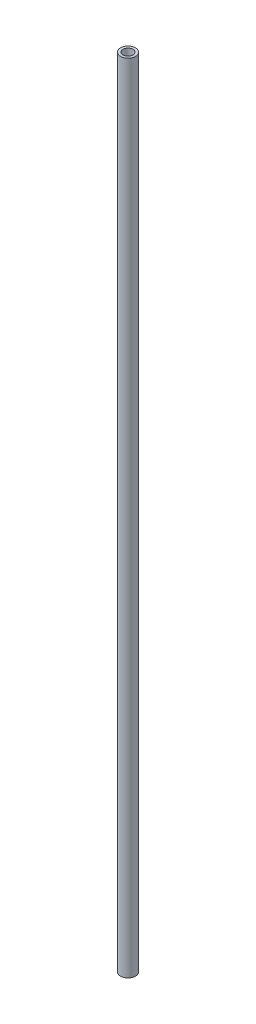
ISO-10303-21;
HEADER;
FILE_DESCRIPTION(('STEP AP214'),'2;1');
FILE_NAME('part.step','',(''),(''),'','','');
FILE_SCHEMA(('AUTOMOTIVE_DESIGN { 1 0 10303 214 1 1 1 1 }'));
ENDSEC;
DATA;
#1=APPLICATION_CONTEXT('core data for automotive mechanical design processes');
#2=APPLICATION_PROTOCOL_DEFINITION('international standard','automotive_design',2000,#1);
#3=PRODUCT_CONTEXT('',#1,'mechanical');
#4=PRODUCT('Part','Part','',(#3));
#5=PRODUCT_RELATED_PRODUCT_CATEGORY('part','',(#4));
#6=PRODUCT_DEFINITION_FORMATION('','',#4);
#7=PRODUCT_DEFINITION_CONTEXT('part definition',#1,'design');
#8=PRODUCT_DEFINITION('design','',#6,#7);
#9=PRODUCT_DEFINITION_SHAPE('','',#8);
#10=(LENGTH_UNIT() NAMED_UNIT(*) SI_UNIT(.MILLI.,.METRE.));
#11=(NAMED_UNIT(*) PLANE_ANGLE_UNIT() SI_UNIT($,.RADIAN.));
#12=(NAMED_UNIT(*) SI_UNIT($,.STERADIAN.) SOLID_ANGLE_UNIT());
#13=UNCERTAINTY_MEASURE_WITH_UNIT(LENGTH_MEASURE(1.E-05),#10,'distance_accuracy_value','');
#14=(GEOMETRIC_REPRESENTATION_CONTEXT(3) GLOBAL_UNCERTAINTY_ASSIGNED_CONTEXT((#13)) GLOBAL_UNIT_ASSIGNED_CONTEXT((#10,
#11,#12)) REPRESENTATION_CONTEXT('',''));
#15=CARTESIAN_POINT('',(0.,0.,0.));
#16=DIRECTION('',(0.,0.,1.));
#17=DIRECTION('',(1.,0.,0.));
#18=AXIS2_PLACEMENT_3D('',#15,#16,#17);
#19=CARTESIAN_POINT('',(0.,1016.,0.));
#20=DIRECTION('',(0.,1.,0.));
#21=DIRECTION('',(0.,0.,1.));
#22=AXIS2_PLACEMENT_3D('',#19,#20,#21);
#23=PLANE('',#22);
#24=CARTESIAN_POINT('',(0.,1016.,0.));
#25=DIRECTION('',(0.,1.,0.));
#26=DIRECTION('',(0.,0.,1.));
#27=AXIS2_PLACEMENT_3D('',#24,#25,#26);
#28=CIRCLE('',#27,9.525);
#29=CARTESIAN_POINT('',(0.,1016.,9.525));
#30=VERTEX_POINT('',#29);
#31=EDGE_CURVE('E10',#30,#30,#28,.T.);
#32=ORIENTED_EDGE('',*,*,#31,.T.);
#33=EDGE_LOOP('',(#32));
#34=FACE_BOUND('',#33,.T.);
#35=CARTESIAN_POINT('',(0.,1016.,0.));
#36=DIRECTION('',(0.,1.,0.));
#37=DIRECTION('',(0.,0.,1.));
#38=AXIS2_PLACEMENT_3D('',#35,#36,#37);
#39=CIRCLE('',#38,6.35);
#40=CARTESIAN_POINT('',(0.,1016.,6.35));
#41=VERTEX_POINT('',#40);
#42=EDGE_CURVE('E50',#41,#41,#39,.T.);
#43=ORIENTED_EDGE('',*,*,#42,.F.);
#44=EDGE_LOOP('',(#43));
#45=FACE_BOUND('',#44,.T.);
#46=ADVANCED_FACE('F37',(#34,#45),#23,.T.);
#47=CARTESIAN_POINT('',(0.,0.,0.));
#48=DIRECTION('',(0.,1.,0.));
#49=DIRECTION('',(0.,0.,1.));
#50=AXIS2_PLACEMENT_3D('',#47,#48,#49);
#51=PLANE('',#50);
#52=CARTESIAN_POINT('',(0.,0.,0.));
#53=DIRECTION('',(0.,1.,0.));
#54=DIRECTION('',(0.,0.,1.));
#55=AXIS2_PLACEMENT_3D('',#52,#53,#54);
#56=CIRCLE('',#55,9.525);
#57=CARTESIAN_POINT('',(0.,0.,9.525));
#58=VERTEX_POINT('',#57);
#59=EDGE_CURVE('E41',#58,#58,#56,.T.);
#60=ORIENTED_EDGE('',*,*,#59,.F.);
#61=EDGE_LOOP('',(#60));
#62=FACE_BOUND('',#61,.T.);
#63=CARTESIAN_POINT('',(0.,0.,0.));
#64=DIRECTION('',(0.,1.,0.));
#65=DIRECTION('',(0.,0.,1.));
#66=AXIS2_PLACEMENT_3D('',#63,#64,#65);
#67=CIRCLE('',#66,6.35);
#68=CARTESIAN_POINT('',(0.,0.,6.35));
#69=VERTEX_POINT('',#68);
#70=EDGE_CURVE('E52',#69,#69,#67,.T.);
#71=ORIENTED_EDGE('',*,*,#70,.T.);
#72=EDGE_LOOP('',(#71));
#73=FACE_BOUND('',#72,.T.);
#74=ADVANCED_FACE('F64',(#62,#73),#51,.F.);
#75=CARTESIAN_POINT('',(0.,1016.,0.));
#76=DIRECTION('',(0.,-1.,0.));
#77=DIRECTION('',(0.,0.,-1.));
#78=AXIS2_PLACEMENT_3D('',#75,#76,#77);
#79=CYLINDRICAL_SURFACE('',#78,9.525);
#80=ORIENTED_EDGE('',*,*,#31,.F.);
#81=EDGE_LOOP('',(#80));
#82=FACE_BOUND('',#81,.T.);
#83=ORIENTED_EDGE('',*,*,#59,.T.);
#84=EDGE_LOOP('',(#83));
#85=FACE_BOUND('',#84,.T.);
#86=ADVANCED_FACE('F39',(#82,#85),#79,.T.);
#87=CARTESIAN_POINT('',(0.,1016.,0.));
#88=DIRECTION('',(0.,-1.,0.));
#89=DIRECTION('',(0.,0.,-1.));
#90=AXIS2_PLACEMENT_3D('',#87,#88,#89);
#91=CYLINDRICAL_SURFACE('',#90,6.35);
#92=ORIENTED_EDGE('',*,*,#42,.T.);
#93=EDGE_LOOP('',(#92));
#94=FACE_BOUND('',#93,.T.);
#95=ORIENTED_EDGE('',*,*,#70,.F.);
#96=EDGE_LOOP('',(#95));
#97=FACE_BOUND('',#96,.T.);
#98=ADVANCED_FACE('F60',(#94,#97),#91,.F.);
#99=CLOSED_SHELL('',(#46,#74,#86,#98));
#100=MANIFOLD_SOLID_BREP('B2',#99);
#101=ADVANCED_BREP_SHAPE_REPRESENTATION('',(#18,#100),#14);
#102=SHAPE_DEFINITION_REPRESENTATION(#9,#101);
ENDSEC;
END-ISO-10303-21;
